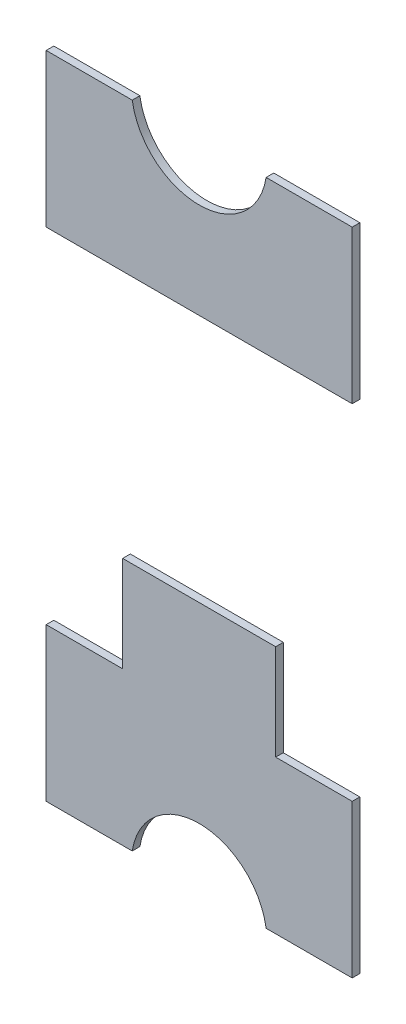
ISO-10303-21;
HEADER;
FILE_DESCRIPTION(('STEP AP214'),'2;1');
FILE_NAME('part.step','',(''),(''),'','','');
FILE_SCHEMA(('AUTOMOTIVE_DESIGN { 1 0 10303 214 1 1 1 1 }'));
ENDSEC;
DATA;
#1=APPLICATION_CONTEXT('core data for automotive mechanical design processes');
#2=APPLICATION_PROTOCOL_DEFINITION('international standard','automotive_design',2000,#1);
#3=PRODUCT_CONTEXT('',#1,'mechanical');
#4=PRODUCT('Part','Part','',(#3));
#5=PRODUCT_RELATED_PRODUCT_CATEGORY('part','',(#4));
#6=PRODUCT_DEFINITION_FORMATION('','',#4);
#7=PRODUCT_DEFINITION_CONTEXT('part definition',#1,'design');
#8=PRODUCT_DEFINITION('design','',#6,#7);
#9=PRODUCT_DEFINITION_SHAPE('','',#8);
#10=(LENGTH_UNIT() NAMED_UNIT(*) SI_UNIT(.MILLI.,.METRE.));
#11=(NAMED_UNIT(*) PLANE_ANGLE_UNIT() SI_UNIT($,.RADIAN.));
#12=(NAMED_UNIT(*) SI_UNIT($,.STERADIAN.) SOLID_ANGLE_UNIT());
#13=UNCERTAINTY_MEASURE_WITH_UNIT(LENGTH_MEASURE(1.E-05),#10,'distance_accuracy_value','');
#14=(GEOMETRIC_REPRESENTATION_CONTEXT(3) GLOBAL_UNCERTAINTY_ASSIGNED_CONTEXT((#13)) GLOBAL_UNIT_ASSIGNED_CONTEXT((#10,
#11,#12)) REPRESENTATION_CONTEXT('',''));
#15=CARTESIAN_POINT('',(0.,0.,0.));
#16=DIRECTION('',(0.,0.,1.));
#17=DIRECTION('',(1.,0.,0.));
#18=AXIS2_PLACEMENT_3D('',#15,#16,#17);
#19=CARTESIAN_POINT('',(-0.175,0.85,0.));
#20=DIRECTION('',(0.,0.,-1.));
#21=DIRECTION('',(-1.,0.,0.));
#22=AXIS2_PLACEMENT_3D('',#19,#20,#21);
#23=PLANE('',#22);
#24=DIRECTION('',(0.,1.,0.));
#25=VECTOR('',#24,1.);
#26=CARTESIAN_POINT('',(0.4,0.45,0.));
#27=LINE('',#26,#25);
#28=CARTESIAN_POINT('',(0.4,0.85,0.));
#29=VERTEX_POINT('',#28);
#30=CARTESIAN_POINT('',(0.4,0.45,0.));
#31=VERTEX_POINT('',#30);
#32=EDGE_CURVE('P0_E88',#29,#31,#27,.F.);
#33=ORIENTED_EDGE('',*,*,#32,.T.);
#34=DIRECTION('',(1.,0.,0.));
#35=VECTOR('',#34,1.);
#36=CARTESIAN_POINT('',(-0.4,0.45,0.));
#37=LINE('',#36,#35);
#38=CARTESIAN_POINT('',(-0.4,0.45,0.));
#39=VERTEX_POINT('',#38);
#40=EDGE_CURVE('P0_E102',#31,#39,#37,.F.);
#41=ORIENTED_EDGE('',*,*,#40,.T.);
#42=DIRECTION('',(0.,1.,0.));
#43=VECTOR('',#42,1.);
#44=CARTESIAN_POINT('',(-0.4,0.85,0.));
#45=LINE('',#44,#43);
#46=CARTESIAN_POINT('',(-0.4,0.85,0.));
#47=VERTEX_POINT('',#46);
#48=EDGE_CURVE('P0_E109',#39,#47,#45,.T.);
#49=ORIENTED_EDGE('',*,*,#48,.T.);
#50=DIRECTION('',(1.,0.,0.));
#51=VECTOR('',#50,1.);
#52=CARTESIAN_POINT('',(-0.175,0.85,0.));
#53=LINE('',#52,#51);
#54=CARTESIAN_POINT('',(-0.174999999999718,0.850000000000022,0.));
#55=VERTEX_POINT('',#54);
#56=EDGE_CURVE('P0_E66',#47,#55,#53,.T.);
#57=ORIENTED_EDGE('',*,*,#56,.T.);
#58=CARTESIAN_POINT('',(0.,0.877083333333,0.));
#59=DIRECTION('',(0.,0.,-1.));
#60=DIRECTION('',(-1.,0.,0.));
#61=AXIS2_PLACEMENT_3D('',#58,#59,#60);
#62=CIRCLE('',#61,0.177083333333);
#63=CARTESIAN_POINT('',(0.174999999999857,0.85,0.));
#64=VERTEX_POINT('',#63);
#65=EDGE_CURVE('P0_E20',#55,#64,#62,.F.);
#66=ORIENTED_EDGE('',*,*,#65,.T.);
#67=DIRECTION('',(1.,0.,0.));
#68=VECTOR('',#67,1.);
#69=CARTESIAN_POINT('',(0.4,0.85,0.));
#70=LINE('',#69,#68);
#71=EDGE_CURVE('P0_E72',#64,#29,#70,.T.);
#72=ORIENTED_EDGE('',*,*,#71,.T.);
#73=EDGE_LOOP('',(#33,#41,#49,#57,#66,#72));
#74=FACE_BOUND('',#73,.T.);
#75=ADVANCED_FACE('P0_F17',(#74),#23,.T.);
#76=CARTESIAN_POINT('',(-0.175,0.85,0.));
#77=DIRECTION('',(0.,-1.,0.));
#78=DIRECTION('',(0.,0.,-1.));
#79=AXIS2_PLACEMENT_3D('',#76,#77,#78);
#80=PLANE('',#79);
#81=DIRECTION('',(-1.,0.,0.));
#82=VECTOR('',#81,1.);
#83=CARTESIAN_POINT('',(-0.175,0.85,0.01999999955297));
#84=LINE('',#83,#82);
#85=CARTESIAN_POINT('',(-0.4,0.85,0.01999999955297));
#86=VERTEX_POINT('',#85);
#87=CARTESIAN_POINT('',(-0.174999999999718,0.850000000000022,0.01999999955297));
#88=VERTEX_POINT('',#87);
#89=EDGE_CURVE('P0_E126',#86,#88,#84,.F.);
#90=ORIENTED_EDGE('',*,*,#89,.T.);
#91=DIRECTION('',(0.,0.,-1.));
#92=VECTOR('',#91,1.);
#93=CARTESIAN_POINT('',(-0.174999999999721,0.850000000000043,0.));
#94=LINE('',#93,#92);
#95=EDGE_CURVE('P0_E83',#88,#55,#94,.T.);
#96=ORIENTED_EDGE('',*,*,#95,.T.);
#97=ORIENTED_EDGE('',*,*,#56,.F.);
#98=DIRECTION('',(0.,0.,-1.));
#99=VECTOR('',#98,1.);
#100=CARTESIAN_POINT('',(-0.4,0.85,0.));
#101=LINE('',#100,#99);
#102=EDGE_CURVE('P0_E106',#47,#86,#101,.F.);
#103=ORIENTED_EDGE('',*,*,#102,.T.);
#104=EDGE_LOOP('',(#90,#96,#97,#103));
#105=FACE_BOUND('',#104,.T.);
#106=ADVANCED_FACE('P0_F153',(#105),#80,.F.);
#107=CARTESIAN_POINT('',(0.,0.877083333333,0.));
#108=DIRECTION('',(0.,0.,-1.));
#109=DIRECTION('',(-1.,0.,0.));
#110=AXIS2_PLACEMENT_3D('',#107,#108,#109);
#111=CYLINDRICAL_SURFACE('',#110,0.177083333333);
#112=ORIENTED_EDGE('',*,*,#65,.F.);
#113=ORIENTED_EDGE('',*,*,#95,.F.);
#114=CARTESIAN_POINT('',(0.,0.877083333333,0.01999999955297));
#115=DIRECTION('',(0.,0.,-1.));
#116=DIRECTION('',(-1.,0.,0.));
#117=AXIS2_PLACEMENT_3D('',#114,#115,#116);
#118=CIRCLE('',#117,0.177083333333);
#119=CARTESIAN_POINT('',(0.174999999999857,0.85,0.01999999955297));
#120=VERTEX_POINT('',#119);
#121=EDGE_CURVE('P0_E87',#88,#120,#118,.F.);
#122=ORIENTED_EDGE('',*,*,#121,.T.);
#123=DIRECTION('',(0.,0.,-1.));
#124=VECTOR('',#123,1.);
#125=CARTESIAN_POINT('',(0.175,0.85,0.));
#126=LINE('',#125,#124);
#127=EDGE_CURVE('P0_E76',#120,#64,#126,.T.);
#128=ORIENTED_EDGE('',*,*,#127,.T.);
#129=EDGE_LOOP('',(#112,#113,#122,#128));
#130=FACE_BOUND('',#129,.T.);
#131=ADVANCED_FACE('P0_F85',(#130),#111,.F.);
#132=CARTESIAN_POINT('',(0.4,0.85,0.));
#133=DIRECTION('',(0.,-1.,0.));
#134=DIRECTION('',(0.,0.,-1.));
#135=AXIS2_PLACEMENT_3D('',#132,#133,#134);
#136=PLANE('',#135);
#137=DIRECTION('',(-1.,0.,0.));
#138=VECTOR('',#137,1.);
#139=CARTESIAN_POINT('',(-0.175,0.85,0.01999999955297));
#140=LINE('',#139,#138);
#141=CARTESIAN_POINT('',(0.4,0.85,0.01999999955297));
#142=VERTEX_POINT('',#141);
#143=EDGE_CURVE('P0_E98',#120,#142,#140,.F.);
#144=ORIENTED_EDGE('',*,*,#143,.T.);
#145=DIRECTION('',(0.,0.,1.));
#146=VECTOR('',#145,1.);
#147=CARTESIAN_POINT('',(0.4,0.85,0.));
#148=LINE('',#147,#146);
#149=EDGE_CURVE('P0_E78',#142,#29,#148,.F.);
#150=ORIENTED_EDGE('',*,*,#149,.T.);
#151=ORIENTED_EDGE('',*,*,#71,.F.);
#152=ORIENTED_EDGE('',*,*,#127,.F.);
#153=EDGE_LOOP('',(#144,#150,#151,#152));
#154=FACE_BOUND('',#153,.T.);
#155=ADVANCED_FACE('P0_F74',(#154),#136,.F.);
#156=CARTESIAN_POINT('',(0.4,0.45,0.));
#157=DIRECTION('',(-1.,0.,0.));
#158=DIRECTION('',(0.,0.,1.));
#159=AXIS2_PLACEMENT_3D('',#156,#157,#158);
#160=PLANE('',#159);
#161=DIRECTION('',(0.,1.,0.));
#162=VECTOR('',#161,1.);
#163=CARTESIAN_POINT('',(0.4,0.85,0.01999999955297));
#164=LINE('',#163,#162);
#165=CARTESIAN_POINT('',(0.4,0.45,0.01999999955297));
#166=VERTEX_POINT('',#165);
#167=EDGE_CURVE('P0_E95',#142,#166,#164,.F.);
#168=ORIENTED_EDGE('',*,*,#167,.T.);
#169=DIRECTION('',(0.,0.,1.));
#170=VECTOR('',#169,1.);
#171=CARTESIAN_POINT('',(0.4,0.45,0.));
#172=LINE('',#171,#170);
#173=EDGE_CURVE('P0_E118',#166,#31,#172,.F.);
#174=ORIENTED_EDGE('',*,*,#173,.T.);
#175=ORIENTED_EDGE('',*,*,#32,.F.);
#176=ORIENTED_EDGE('',*,*,#149,.F.);
#177=EDGE_LOOP('',(#168,#174,#175,#176));
#178=FACE_BOUND('',#177,.T.);
#179=ADVANCED_FACE('P0_F150',(#178),#160,.F.);
#180=CARTESIAN_POINT('',(-0.4,0.45,0.));
#181=DIRECTION('',(0.,1.,0.));
#182=DIRECTION('',(0.,0.,1.));
#183=AXIS2_PLACEMENT_3D('',#180,#181,#182);
#184=PLANE('',#183);
#185=DIRECTION('',(-1.,0.,0.));
#186=VECTOR('',#185,1.);
#187=CARTESIAN_POINT('',(-0.175,0.45,0.01999999955297));
#188=LINE('',#187,#186);
#189=CARTESIAN_POINT('',(-0.4,0.45,0.01999999955297));
#190=VERTEX_POINT('',#189);
#191=EDGE_CURVE('P0_E26',#166,#190,#188,.T.);
#192=ORIENTED_EDGE('',*,*,#191,.T.);
#193=DIRECTION('',(0.,0.,-1.));
#194=VECTOR('',#193,1.);
#195=CARTESIAN_POINT('',(-0.4,0.45,0.));
#196=LINE('',#195,#194);
#197=EDGE_CURVE('P0_E34',#190,#39,#196,.T.);
#198=ORIENTED_EDGE('',*,*,#197,.T.);
#199=ORIENTED_EDGE('',*,*,#40,.F.);
#200=ORIENTED_EDGE('',*,*,#173,.F.);
#201=EDGE_LOOP('',(#192,#198,#199,#200));
#202=FACE_BOUND('',#201,.T.);
#203=ADVANCED_FACE('P0_F145',(#202),#184,.F.);
#204=CARTESIAN_POINT('',(-0.4,0.85,0.));
#205=DIRECTION('',(1.,0.,0.));
#206=DIRECTION('',(0.,0.,-1.));
#207=AXIS2_PLACEMENT_3D('',#204,#205,#206);
#208=PLANE('',#207);
#209=DIRECTION('',(0.,1.,0.));
#210=VECTOR('',#209,1.);
#211=CARTESIAN_POINT('',(-0.4,0.85,0.01999999955297));
#212=LINE('',#211,#210);
#213=EDGE_CURVE('P0_E11',#190,#86,#212,.T.);
#214=ORIENTED_EDGE('',*,*,#213,.T.);
#215=ORIENTED_EDGE('',*,*,#102,.F.);
#216=ORIENTED_EDGE('',*,*,#48,.F.);
#217=ORIENTED_EDGE('',*,*,#197,.F.);
#218=EDGE_LOOP('',(#214,#215,#216,#217));
#219=FACE_BOUND('',#218,.T.);
#220=ADVANCED_FACE('P0_F152',(#219),#208,.F.);
#221=CARTESIAN_POINT('',(-0.175,0.85,0.01999999955297));
#222=DIRECTION('',(0.,0.,-1.));
#223=DIRECTION('',(-1.,0.,0.));
#224=AXIS2_PLACEMENT_3D('',#221,#222,#223);
#225=PLANE('',#224);
#226=ORIENTED_EDGE('',*,*,#191,.F.);
#227=ORIENTED_EDGE('',*,*,#167,.F.);
#228=ORIENTED_EDGE('',*,*,#143,.F.);
#229=ORIENTED_EDGE('',*,*,#121,.F.);
#230=ORIENTED_EDGE('',*,*,#89,.F.);
#231=ORIENTED_EDGE('',*,*,#213,.F.);
#232=EDGE_LOOP('',(#226,#227,#228,#229,#230,#231));
#233=FACE_BOUND('',#232,.T.);
#234=ADVANCED_FACE('P0_F148',(#233),#225,.F.);
#235=CLOSED_SHELL('',(#75,#106,#131,#155,#179,#203,#220,#234));
#236=MANIFOLD_SOLID_BREP('P0_B1',#235);
#237=CARTESIAN_POINT('',(-0.4,-0.85,0.01999999955297));
#238=DIRECTION('',(0.,0.,1.));
#239=DIRECTION('',(1.,0.,0.));
#240=AXIS2_PLACEMENT_3D('',#237,#238,#239);
#241=PLANE('',#240);
#242=DIRECTION('',(1.,0.,0.));
#243=VECTOR('',#242,1.);
#244=CARTESIAN_POINT('',(-0.2,-0.2,0.01999999955297));
#245=LINE('',#244,#243);
#246=CARTESIAN_POINT('',(-0.2,-0.2,0.01999999955297));
#247=VERTEX_POINT('',#246);
#248=CARTESIAN_POINT('',(0.2,-0.2,0.01999999955297));
#249=VERTEX_POINT('',#248);
#250=EDGE_CURVE('P1_E179',#247,#249,#245,.T.);
#251=ORIENTED_EDGE('',*,*,#250,.F.);
#252=DIRECTION('',(0.,1.,0.));
#253=VECTOR('',#252,1.);
#254=CARTESIAN_POINT('',(-0.2,-0.45,0.01999999955297));
#255=LINE('',#254,#253);
#256=CARTESIAN_POINT('',(-0.2,-0.45,0.01999999955297));
#257=VERTEX_POINT('',#256);
#258=EDGE_CURVE('P1_E172',#257,#247,#255,.T.);
#259=ORIENTED_EDGE('',*,*,#258,.F.);
#260=DIRECTION('',(1.,0.,0.));
#261=VECTOR('',#260,1.);
#262=CARTESIAN_POINT('',(-0.4,-0.45,0.01999999955297));
#263=LINE('',#262,#261);
#264=CARTESIAN_POINT('',(-0.4,-0.45,0.01999999955297));
#265=VERTEX_POINT('',#264);
#266=EDGE_CURVE('P1_E138',#265,#257,#263,.T.);
#267=ORIENTED_EDGE('',*,*,#266,.F.);
#268=DIRECTION('',(0.,1.,0.));
#269=VECTOR('',#268,1.);
#270=CARTESIAN_POINT('',(-0.4,-0.85,0.01999999955297));
#271=LINE('',#270,#269);
#272=CARTESIAN_POINT('',(-0.4,-0.85,0.01999999955297));
#273=VERTEX_POINT('',#272);
#274=EDGE_CURVE('P1_E131',#273,#265,#271,.T.);
#275=ORIENTED_EDGE('',*,*,#274,.F.);
#276=DIRECTION('',(1.,0.,0.));
#277=VECTOR('',#276,1.);
#278=CARTESIAN_POINT('',(-0.175,-0.85,0.01999999955297));
#279=LINE('',#278,#277);
#280=CARTESIAN_POINT('',(-0.174999999999718,-0.850000000000022,0.01999999955297));
#281=VERTEX_POINT('',#280);
#282=EDGE_CURVE('P1_E97',#281,#273,#279,.F.);
#283=ORIENTED_EDGE('',*,*,#282,.F.);
#284=CARTESIAN_POINT('',(0.,-0.877083333333,0.01999999955297));
#285=DIRECTION('',(0.,0.,-1.));
#286=DIRECTION('',(-1.,0.,0.));
#287=AXIS2_PLACEMENT_3D('',#284,#285,#286);
#288=CIRCLE('',#287,0.177083333333);
#289=CARTESIAN_POINT('',(0.174999999999857,-0.85,0.01999999955297));
#290=VERTEX_POINT('',#289);
#291=EDGE_CURVE('P1_E20',#281,#290,#288,.T.);
#292=ORIENTED_EDGE('',*,*,#291,.T.);
#293=DIRECTION('',(1.,0.,0.));
#294=VECTOR('',#293,1.);
#295=CARTESIAN_POINT('',(0.4,-0.85,0.01999999955297));
#296=LINE('',#295,#294);
#297=CARTESIAN_POINT('',(0.4,-0.85,0.01999999955297));
#298=VERTEX_POINT('',#297);
#299=EDGE_CURVE('P1_E94',#298,#290,#296,.F.);
#300=ORIENTED_EDGE('',*,*,#299,.F.);
#301=DIRECTION('',(0.,1.,0.));
#302=VECTOR('',#301,1.);
#303=CARTESIAN_POINT('',(0.4,-0.45,0.01999999955297));
#304=LINE('',#303,#302);
#305=CARTESIAN_POINT('',(0.4,-0.45,0.01999999955297));
#306=VERTEX_POINT('',#305);
#307=EDGE_CURVE('P1_E126',#306,#298,#304,.F.);
#308=ORIENTED_EDGE('',*,*,#307,.F.);
#309=DIRECTION('',(1.,0.,0.));
#310=VECTOR('',#309,1.);
#311=CARTESIAN_POINT('',(0.2,-0.45,0.01999999955297));
#312=LINE('',#311,#310);
#313=CARTESIAN_POINT('',(0.2,-0.45,0.01999999955297));
#314=VERTEX_POINT('',#313);
#315=EDGE_CURVE('P1_E185',#314,#306,#312,.T.);
#316=ORIENTED_EDGE('',*,*,#315,.F.);
#317=DIRECTION('',(0.,1.,0.));
#318=VECTOR('',#317,1.);
#319=CARTESIAN_POINT('',(0.2,-0.2,0.01999999955297));
#320=LINE('',#319,#318);
#321=EDGE_CURVE('P1_E181',#249,#314,#320,.F.);
#322=ORIENTED_EDGE('',*,*,#321,.F.);
#323=EDGE_LOOP('',(#251,#259,#267,#275,#283,#292,#300,#308,#316,#322));
#324=FACE_BOUND('',#323,.T.);
#325=ADVANCED_FACE('P1_F17',(#324),#241,.T.);
#326=CARTESIAN_POINT('',(-0.4,-0.85,0.));
#327=DIRECTION('',(-1.,0.,0.));
#328=DIRECTION('',(0.,0.,1.));
#329=AXIS2_PLACEMENT_3D('',#326,#327,#328);
#330=PLANE('',#329);
#331=DIRECTION('',(0.,0.,-1.));
#332=VECTOR('',#331,1.);
#333=CARTESIAN_POINT('',(-0.4,-0.85,0.));
#334=LINE('',#333,#332);
#335=CARTESIAN_POINT('',(-0.4,-0.85,0.));
#336=VERTEX_POINT('',#335);
#337=EDGE_CURVE('P1_E129',#273,#336,#334,.T.);
#338=ORIENTED_EDGE('',*,*,#337,.F.);
#339=ORIENTED_EDGE('',*,*,#274,.T.);
#340=DIRECTION('',(0.,0.,1.));
#341=VECTOR('',#340,1.);
#342=CARTESIAN_POINT('',(-0.4,-0.45,0.));
#343=LINE('',#342,#341);
#344=CARTESIAN_POINT('',(-0.4,-0.45,0.));
#345=VERTEX_POINT('',#344);
#346=EDGE_CURVE('P1_E141',#345,#265,#343,.T.);
#347=ORIENTED_EDGE('',*,*,#346,.F.);
#348=DIRECTION('',(0.,1.,0.));
#349=VECTOR('',#348,1.);
#350=CARTESIAN_POINT('',(-0.4,-0.85,0.));
#351=LINE('',#350,#349);
#352=EDGE_CURVE('P1_E134',#345,#336,#351,.F.);
#353=ORIENTED_EDGE('',*,*,#352,.T.);
#354=EDGE_LOOP('',(#338,#339,#347,#353));
#355=FACE_BOUND('',#354,.T.);
#356=ADVANCED_FACE('P1_F224',(#355),#330,.T.);
#357=CARTESIAN_POINT('',(-0.175,-0.85,0.));
#358=DIRECTION('',(0.,-1.,0.));
#359=DIRECTION('',(0.,0.,-1.));
#360=AXIS2_PLACEMENT_3D('',#357,#358,#359);
#361=PLANE('',#360);
#362=DIRECTION('',(0.,0.,-1.));
#363=VECTOR('',#362,1.);
#364=CARTESIAN_POINT('',(-0.174999999999721,-0.850000000000043,0.));
#365=LINE('',#364,#363);
#366=CARTESIAN_POINT('',(-0.174999999999718,-0.850000000000022,0.));
#367=VERTEX_POINT('',#366);
#368=EDGE_CURVE('P1_E99',#367,#281,#365,.F.);
#369=ORIENTED_EDGE('',*,*,#368,.T.);
#370=ORIENTED_EDGE('',*,*,#282,.T.);
#371=ORIENTED_EDGE('',*,*,#337,.T.);
#372=DIRECTION('',(1.,0.,0.));
#373=VECTOR('',#372,1.);
#374=CARTESIAN_POINT('',(-0.4,-0.85,0.));
#375=LINE('',#374,#373);
#376=EDGE_CURVE('P1_E137',#336,#367,#375,.T.);
#377=ORIENTED_EDGE('',*,*,#376,.T.);
#378=EDGE_LOOP('',(#369,#370,#371,#377));
#379=FACE_BOUND('',#378,.T.);
#380=ADVANCED_FACE('P1_F225',(#379),#361,.T.);
#381=CARTESIAN_POINT('',(0.,-0.877083333333,0.));
#382=DIRECTION('',(0.,0.,-1.));
#383=DIRECTION('',(-1.,0.,0.));
#384=AXIS2_PLACEMENT_3D('',#381,#382,#383);
#385=CYLINDRICAL_SURFACE('',#384,0.177083333333);
#386=CARTESIAN_POINT('',(0.,-0.877083333333,0.));
#387=DIRECTION('',(0.,0.,-1.));
#388=DIRECTION('',(-1.,0.,0.));
#389=AXIS2_PLACEMENT_3D('',#386,#387,#388);
#390=CIRCLE('',#389,0.177083333333);
#391=CARTESIAN_POINT('',(0.174999999999857,-0.85,0.));
#392=VERTEX_POINT('',#391);
#393=EDGE_CURVE('P1_E111',#367,#392,#390,.T.);
#394=ORIENTED_EDGE('',*,*,#393,.T.);
#395=DIRECTION('',(0.,0.,-1.));
#396=VECTOR('',#395,1.);
#397=CARTESIAN_POINT('',(0.175,-0.85,0.));
#398=LINE('',#397,#396);
#399=EDGE_CURVE('P1_E104',#290,#392,#398,.T.);
#400=ORIENTED_EDGE('',*,*,#399,.F.);
#401=ORIENTED_EDGE('',*,*,#291,.F.);
#402=ORIENTED_EDGE('',*,*,#368,.F.);
#403=EDGE_LOOP('',(#394,#400,#401,#402));
#404=FACE_BOUND('',#403,.T.);
#405=ADVANCED_FACE('P1_F109',(#404),#385,.F.);
#406=CARTESIAN_POINT('',(0.4,-0.85,0.));
#407=DIRECTION('',(0.,-1.,0.));
#408=DIRECTION('',(0.,0.,-1.));
#409=AXIS2_PLACEMENT_3D('',#406,#407,#408);
#410=PLANE('',#409);
#411=DIRECTION('',(0.,0.,-1.));
#412=VECTOR('',#411,1.);
#413=CARTESIAN_POINT('',(0.4,-0.85,0.));
#414=LINE('',#413,#412);
#415=CARTESIAN_POINT('',(0.4,-0.85,0.));
#416=VERTEX_POINT('',#415);
#417=EDGE_CURVE('P1_E106',#298,#416,#414,.T.);
#418=ORIENTED_EDGE('',*,*,#417,.F.);
#419=ORIENTED_EDGE('',*,*,#299,.T.);
#420=ORIENTED_EDGE('',*,*,#399,.T.);
#421=DIRECTION('',(1.,0.,0.));
#422=VECTOR('',#421,1.);
#423=CARTESIAN_POINT('',(-0.4,-0.85,0.));
#424=LINE('',#423,#422);
#425=EDGE_CURVE('P1_E122',#392,#416,#424,.T.);
#426=ORIENTED_EDGE('',*,*,#425,.T.);
#427=EDGE_LOOP('',(#418,#419,#420,#426));
#428=FACE_BOUND('',#427,.T.);
#429=ADVANCED_FACE('P1_F102',(#428),#410,.T.);
#430=CARTESIAN_POINT('',(0.4,-0.45,0.));
#431=DIRECTION('',(1.,0.,0.));
#432=DIRECTION('',(0.,0.,-1.));
#433=AXIS2_PLACEMENT_3D('',#430,#431,#432);
#434=PLANE('',#433);
#435=DIRECTION('',(0.,0.,1.));
#436=VECTOR('',#435,1.);
#437=CARTESIAN_POINT('',(0.4,-0.45,0.));
#438=LINE('',#437,#436);
#439=CARTESIAN_POINT('',(0.4,-0.45,0.));
#440=VERTEX_POINT('',#439);
#441=EDGE_CURVE('P1_E116',#306,#440,#438,.F.);
#442=ORIENTED_EDGE('',*,*,#441,.F.);
#443=ORIENTED_EDGE('',*,*,#307,.T.);
#444=ORIENTED_EDGE('',*,*,#417,.T.);
#445=DIRECTION('',(0.,1.,0.));
#446=VECTOR('',#445,1.);
#447=CARTESIAN_POINT('',(0.4,-0.85,0.));
#448=LINE('',#447,#446);
#449=EDGE_CURVE('P1_E118',#416,#440,#448,.T.);
#450=ORIENTED_EDGE('',*,*,#449,.T.);
#451=EDGE_LOOP('',(#442,#443,#444,#450));
#452=FACE_BOUND('',#451,.T.);
#453=ADVANCED_FACE('P1_F203',(#452),#434,.T.);
#454=CARTESIAN_POINT('',(0.2,-0.45,0.));
#455=DIRECTION('',(0.,1.,0.));
#456=DIRECTION('',(0.,0.,1.));
#457=AXIS2_PLACEMENT_3D('',#454,#455,#456);
#458=PLANE('',#457);
#459=DIRECTION('',(0.,0.,-1.));
#460=VECTOR('',#459,1.);
#461=CARTESIAN_POINT('',(0.2,-0.45,0.));
#462=LINE('',#461,#460);
#463=CARTESIAN_POINT('',(0.2,-0.45,0.));
#464=VERTEX_POINT('',#463);
#465=EDGE_CURVE('P1_E184',#314,#464,#462,.T.);
#466=ORIENTED_EDGE('',*,*,#465,.F.);
#467=ORIENTED_EDGE('',*,*,#315,.T.);
#468=ORIENTED_EDGE('',*,*,#441,.T.);
#469=DIRECTION('',(1.,0.,0.));
#470=VECTOR('',#469,1.);
#471=CARTESIAN_POINT('',(-0.4,-0.45,0.));
#472=LINE('',#471,#470);
#473=EDGE_CURVE('P1_E121',#440,#464,#472,.F.);
#474=ORIENTED_EDGE('',*,*,#473,.T.);
#475=EDGE_LOOP('',(#466,#467,#468,#474));
#476=FACE_BOUND('',#475,.T.);
#477=ADVANCED_FACE('P1_F192',(#476),#458,.T.);
#478=CARTESIAN_POINT('',(0.2,-0.2,0.));
#479=DIRECTION('',(1.,0.,0.));
#480=DIRECTION('',(0.,0.,-1.));
#481=AXIS2_PLACEMENT_3D('',#478,#479,#480);
#482=PLANE('',#481);
#483=DIRECTION('',(0.,0.,1.));
#484=VECTOR('',#483,1.);
#485=CARTESIAN_POINT('',(0.2,-0.2,0.));
#486=LINE('',#485,#484);
#487=CARTESIAN_POINT('',(0.2,-0.2,0.));
#488=VERTEX_POINT('',#487);
#489=EDGE_CURVE('P1_E177',#249,#488,#486,.F.);
#490=ORIENTED_EDGE('',*,*,#489,.F.);
#491=ORIENTED_EDGE('',*,*,#321,.T.);
#492=ORIENTED_EDGE('',*,*,#465,.T.);
#493=DIRECTION('',(0.,1.,0.));
#494=VECTOR('',#493,1.);
#495=CARTESIAN_POINT('',(0.2,-0.85,0.));
#496=LINE('',#495,#494);
#497=EDGE_CURVE('P1_E201',#464,#488,#496,.T.);
#498=ORIENTED_EDGE('',*,*,#497,.T.);
#499=EDGE_LOOP('',(#490,#491,#492,#498));
#500=FACE_BOUND('',#499,.T.);
#501=ADVANCED_FACE('P1_F207',(#500),#482,.T.);
#502=CARTESIAN_POINT('',(-0.2,-0.2,0.));
#503=DIRECTION('',(0.,1.,0.));
#504=DIRECTION('',(0.,0.,1.));
#505=AXIS2_PLACEMENT_3D('',#502,#503,#504);
#506=PLANE('',#505);
#507=DIRECTION('',(1.,0.,0.));
#508=VECTOR('',#507,1.);
#509=CARTESIAN_POINT('',(-0.4,-0.2,0.));
#510=LINE('',#509,#508);
#511=CARTESIAN_POINT('',(-0.2,-0.2,0.));
#512=VERTEX_POINT('',#511);
#513=EDGE_CURVE('P1_E212',#488,#512,#510,.F.);
#514=ORIENTED_EDGE('',*,*,#513,.T.);
#515=DIRECTION('',(0.,0.,1.));
#516=VECTOR('',#515,1.);
#517=CARTESIAN_POINT('',(-0.2,-0.2,0.));
#518=LINE('',#517,#516);
#519=EDGE_CURVE('P1_E175',#247,#512,#518,.F.);
#520=ORIENTED_EDGE('',*,*,#519,.F.);
#521=ORIENTED_EDGE('',*,*,#250,.T.);
#522=ORIENTED_EDGE('',*,*,#489,.T.);
#523=EDGE_LOOP('',(#514,#520,#521,#522));
#524=FACE_BOUND('',#523,.T.);
#525=ADVANCED_FACE('P1_F210',(#524),#506,.T.);
#526=CARTESIAN_POINT('',(-0.2,-0.45,0.));
#527=DIRECTION('',(-1.,0.,0.));
#528=DIRECTION('',(0.,0.,1.));
#529=AXIS2_PLACEMENT_3D('',#526,#527,#528);
#530=PLANE('',#529);
#531=DIRECTION('',(0.,0.,1.));
#532=VECTOR('',#531,1.);
#533=CARTESIAN_POINT('',(-0.2,-0.45,0.));
#534=LINE('',#533,#532);
#535=CARTESIAN_POINT('',(-0.2,-0.45,0.));
#536=VERTEX_POINT('',#535);
#537=EDGE_CURVE('P1_E34',#257,#536,#534,.F.);
#538=ORIENTED_EDGE('',*,*,#537,.F.);
#539=ORIENTED_EDGE('',*,*,#258,.T.);
#540=ORIENTED_EDGE('',*,*,#519,.T.);
#541=DIRECTION('',(0.,1.,0.));
#542=VECTOR('',#541,1.);
#543=CARTESIAN_POINT('',(-0.2,-0.85,0.));
#544=LINE('',#543,#542);
#545=EDGE_CURVE('P1_E26',#512,#536,#544,.F.);
#546=ORIENTED_EDGE('',*,*,#545,.T.);
#547=EDGE_LOOP('',(#538,#539,#540,#546));
#548=FACE_BOUND('',#547,.T.);
#549=ADVANCED_FACE('P1_F218',(#548),#530,.T.);
#550=CARTESIAN_POINT('',(-0.4,-0.45,0.));
#551=DIRECTION('',(0.,1.,0.));
#552=DIRECTION('',(0.,0.,1.));
#553=AXIS2_PLACEMENT_3D('',#550,#551,#552);
#554=PLANE('',#553);
#555=ORIENTED_EDGE('',*,*,#346,.T.);
#556=ORIENTED_EDGE('',*,*,#266,.T.);
#557=ORIENTED_EDGE('',*,*,#537,.T.);
#558=DIRECTION('',(1.,0.,0.));
#559=VECTOR('',#558,1.);
#560=CARTESIAN_POINT('',(-0.4,-0.45,0.));
#561=LINE('',#560,#559);
#562=EDGE_CURVE('P1_E11',#536,#345,#561,.F.);
#563=ORIENTED_EDGE('',*,*,#562,.T.);
#564=EDGE_LOOP('',(#555,#556,#557,#563));
#565=FACE_BOUND('',#564,.T.);
#566=ADVANCED_FACE('P1_F220',(#565),#554,.T.);
#567=CARTESIAN_POINT('',(-0.4,-0.85,0.));
#568=DIRECTION('',(0.,0.,1.));
#569=DIRECTION('',(1.,0.,0.));
#570=AXIS2_PLACEMENT_3D('',#567,#568,#569);
#571=PLANE('',#570);
#572=ORIENTED_EDGE('',*,*,#545,.F.);
#573=ORIENTED_EDGE('',*,*,#513,.F.);
#574=ORIENTED_EDGE('',*,*,#497,.F.);
#575=ORIENTED_EDGE('',*,*,#473,.F.);
#576=ORIENTED_EDGE('',*,*,#449,.F.);
#577=ORIENTED_EDGE('',*,*,#425,.F.);
#578=ORIENTED_EDGE('',*,*,#393,.F.);
#579=ORIENTED_EDGE('',*,*,#376,.F.);
#580=ORIENTED_EDGE('',*,*,#352,.F.);
#581=ORIENTED_EDGE('',*,*,#562,.F.);
#582=EDGE_LOOP('',(#572,#573,#574,#575,#576,#577,#578,#579,#580,#581));
#583=FACE_BOUND('',#582,.T.);
#584=ADVANCED_FACE('P1_F198',(#583),#571,.F.);
#585=CLOSED_SHELL('',(#325,#356,#380,#405,#429,#453,#477,#501,#525,#549,#566,#584));
#586=MANIFOLD_SOLID_BREP('P1_B1',#585);
#587=ADVANCED_BREP_SHAPE_REPRESENTATION('',(#18,#236,#586),#14);
#588=SHAPE_DEFINITION_REPRESENTATION(#9,#587);
ENDSEC;
END-ISO-10303-21;
